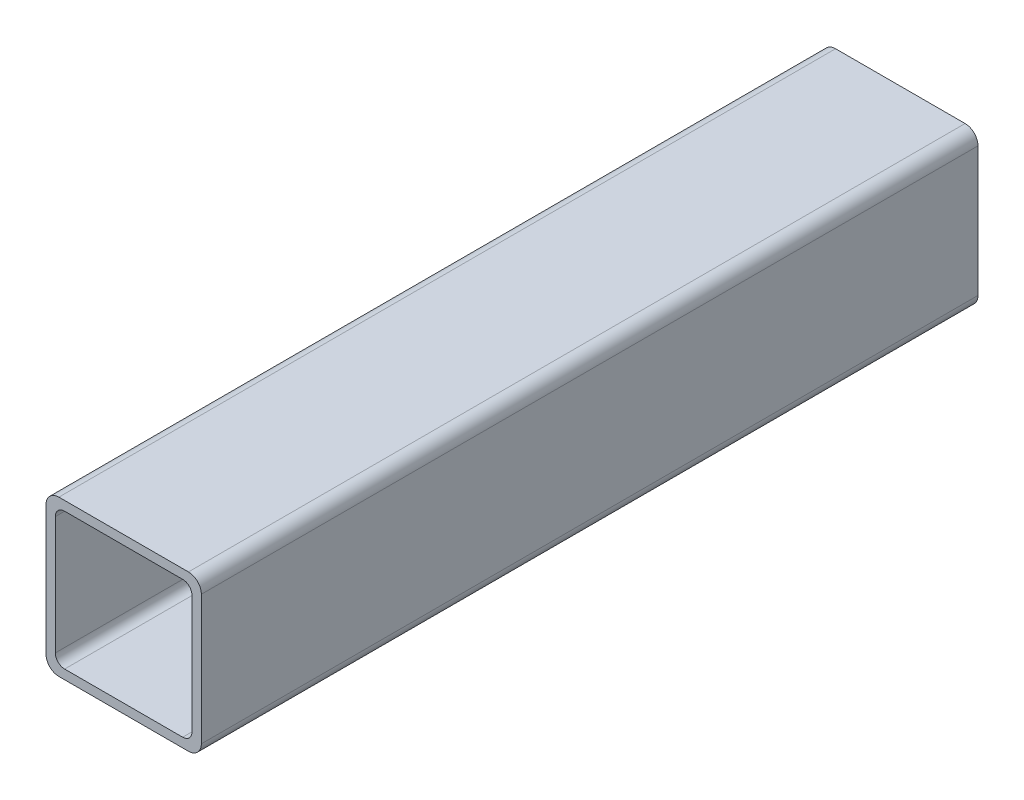
ISO-10303-21;
HEADER;
FILE_DESCRIPTION(('STEP AP214'),'2;1');
FILE_NAME('part.step','',(''),(''),'','','');
FILE_SCHEMA(('AUTOMOTIVE_DESIGN { 1 0 10303 214 1 1 1 1 }'));
ENDSEC;
DATA;
#1=APPLICATION_CONTEXT('core data for automotive mechanical design processes');
#2=APPLICATION_PROTOCOL_DEFINITION('international standard','automotive_design',2000,#1);
#3=PRODUCT_CONTEXT('',#1,'mechanical');
#4=PRODUCT('Part','Part','',(#3));
#5=PRODUCT_RELATED_PRODUCT_CATEGORY('part','',(#4));
#6=PRODUCT_DEFINITION_FORMATION('','',#4);
#7=PRODUCT_DEFINITION_CONTEXT('part definition',#1,'design');
#8=PRODUCT_DEFINITION('design','',#6,#7);
#9=PRODUCT_DEFINITION_SHAPE('','',#8);
#10=(LENGTH_UNIT() NAMED_UNIT(*) SI_UNIT(.MILLI.,.METRE.));
#11=(NAMED_UNIT(*) PLANE_ANGLE_UNIT() SI_UNIT($,.RADIAN.));
#12=(NAMED_UNIT(*) SI_UNIT($,.STERADIAN.) SOLID_ANGLE_UNIT());
#13=UNCERTAINTY_MEASURE_WITH_UNIT(LENGTH_MEASURE(1.E-05),#10,'distance_accuracy_value','');
#14=(GEOMETRIC_REPRESENTATION_CONTEXT(3) GLOBAL_UNCERTAINTY_ASSIGNED_CONTEXT((#13)) GLOBAL_UNIT_ASSIGNED_CONTEXT((#10,
#11,#12)) REPRESENTATION_CONTEXT('',''));
#15=CARTESIAN_POINT('',(0.,0.,0.));
#16=DIRECTION('',(0.,0.,1.));
#17=DIRECTION('',(1.,0.,0.));
#18=AXIS2_PLACEMENT_3D('',#15,#16,#17);
#19=CARTESIAN_POINT('',(-10.5917999999984,-10.5917999999984,-3556.));
#20=DIRECTION('',(0.,0.,-1.));
#21=DIRECTION('',(-1.,0.,0.));
#22=AXIS2_PLACEMENT_3D('',#19,#20,#21);
#23=CYLINDRICAL_SURFACE('',#22,2.10820000000163);
#24=CARTESIAN_POINT('',(-10.5917999999984,-10.5917999999984,-3683.));
#25=DIRECTION('',(0.,0.,-1.));
#26=DIRECTION('',(-1.,0.,0.));
#27=AXIS2_PLACEMENT_3D('',#24,#25,#26);
#28=CIRCLE('',#27,2.10820000000163);
#29=CARTESIAN_POINT('',(-10.5917999999984,-12.7,-3683.));
#30=VERTEX_POINT('',#29);
#31=CARTESIAN_POINT('',(-12.7,-10.5917999999984,-3683.));
#32=VERTEX_POINT('',#31);
#33=EDGE_CURVE('E202',#30,#32,#28,.T.);
#34=ORIENTED_EDGE('',*,*,#33,.F.);
#35=DIRECTION('',(0.,0.,-1.));
#36=VECTOR('',#35,1.);
#37=CARTESIAN_POINT('',(-10.5917999999984,-12.7,-3556.));
#38=LINE('',#37,#36);
#39=CARTESIAN_POINT('',(-10.5917999999984,-12.7,-3556.));
#40=VERTEX_POINT('',#39);
#41=EDGE_CURVE('E11',#40,#30,#38,.T.);
#42=ORIENTED_EDGE('',*,*,#41,.F.);
#43=CARTESIAN_POINT('',(-10.5917999999984,-10.5917999999984,-3556.));
#44=DIRECTION('',(0.,0.,-1.));
#45=DIRECTION('',(-1.,0.,0.));
#46=AXIS2_PLACEMENT_3D('',#43,#44,#45);
#47=CIRCLE('',#46,2.10820000000163);
#48=CARTESIAN_POINT('',(-12.7,-10.5917999999984,-3556.));
#49=VERTEX_POINT('',#48);
#50=EDGE_CURVE('E214',#40,#49,#47,.T.);
#51=ORIENTED_EDGE('',*,*,#50,.T.);
#52=DIRECTION('',(0.,0.,-1.));
#53=VECTOR('',#52,1.);
#54=CARTESIAN_POINT('',(-12.7,-10.5917999999984,-3556.));
#55=LINE('',#54,#53);
#56=EDGE_CURVE('E35',#49,#32,#55,.T.);
#57=ORIENTED_EDGE('',*,*,#56,.T.);
#58=EDGE_LOOP('',(#34,#42,#51,#57));
#59=FACE_BOUND('',#58,.T.);
#60=ADVANCED_FACE('F32',(#59),#23,.T.);
#61=CARTESIAN_POINT('',(10.5917999999984,-12.7,-3556.));
#62=DIRECTION('',(0.,-1.,0.));
#63=DIRECTION('',(1.,0.,0.));
#64=AXIS2_PLACEMENT_3D('',#61,#62,#63);
#65=PLANE('',#64);
#66=DIRECTION('',(-1.,0.,0.));
#67=VECTOR('',#66,1.);
#68=CARTESIAN_POINT('',(10.5917999999984,-12.7,-3683.));
#69=LINE('',#68,#67);
#70=CARTESIAN_POINT('',(10.5917999999984,-12.7,-3683.));
#71=VERTEX_POINT('',#70);
#72=EDGE_CURVE('E218',#71,#30,#69,.T.);
#73=ORIENTED_EDGE('',*,*,#72,.F.);
#74=DIRECTION('',(0.,0.,-1.));
#75=VECTOR('',#74,1.);
#76=CARTESIAN_POINT('',(10.5917999999984,-12.7,-3556.));
#77=LINE('',#76,#75);
#78=CARTESIAN_POINT('',(10.5917999999984,-12.7,-3556.));
#79=VERTEX_POINT('',#78);
#80=EDGE_CURVE('E40',#79,#71,#77,.T.);
#81=ORIENTED_EDGE('',*,*,#80,.F.);
#82=DIRECTION('',(-1.,0.,0.));
#83=VECTOR('',#82,1.);
#84=CARTESIAN_POINT('',(10.5917999999984,-12.7,-3556.));
#85=LINE('',#84,#83);
#86=EDGE_CURVE('E236',#79,#40,#85,.T.);
#87=ORIENTED_EDGE('',*,*,#86,.T.);
#88=ORIENTED_EDGE('',*,*,#41,.T.);
#89=EDGE_LOOP('',(#73,#81,#87,#88));
#90=FACE_BOUND('',#89,.T.);
#91=ADVANCED_FACE('F283',(#90),#65,.T.);
#92=CARTESIAN_POINT('',(10.5917999999984,-10.5917999999984,-3556.));
#93=DIRECTION('',(0.,0.,-1.));
#94=DIRECTION('',(-1.,0.,0.));
#95=AXIS2_PLACEMENT_3D('',#92,#93,#94);
#96=CYLINDRICAL_SURFACE('',#95,2.10820000000163);
#97=CARTESIAN_POINT('',(10.5917999999984,-10.5917999999984,-3683.));
#98=DIRECTION('',(0.,0.,-1.));
#99=DIRECTION('',(-1.,0.,0.));
#100=AXIS2_PLACEMENT_3D('',#97,#98,#99);
#101=CIRCLE('',#100,2.10820000000163);
#102=CARTESIAN_POINT('',(12.7,-10.5917999999984,-3683.));
#103=VERTEX_POINT('',#102);
#104=EDGE_CURVE('E256',#103,#71,#101,.T.);
#105=ORIENTED_EDGE('',*,*,#104,.F.);
#106=DIRECTION('',(0.,0.,-1.));
#107=VECTOR('',#106,1.);
#108=CARTESIAN_POINT('',(12.7,-10.5917999999984,-3556.));
#109=LINE('',#108,#107);
#110=CARTESIAN_POINT('',(12.7,-10.5917999999984,-3556.));
#111=VERTEX_POINT('',#110);
#112=EDGE_CURVE('E262',#111,#103,#109,.T.);
#113=ORIENTED_EDGE('',*,*,#112,.F.);
#114=CARTESIAN_POINT('',(10.5917999999984,-10.5917999999984,-3556.));
#115=DIRECTION('',(0.,0.,-1.));
#116=DIRECTION('',(-1.,0.,0.));
#117=AXIS2_PLACEMENT_3D('',#114,#115,#116);
#118=CIRCLE('',#117,2.10820000000163);
#119=EDGE_CURVE('E233',#111,#79,#118,.T.);
#120=ORIENTED_EDGE('',*,*,#119,.T.);
#121=ORIENTED_EDGE('',*,*,#80,.T.);
#122=EDGE_LOOP('',(#105,#113,#120,#121));
#123=FACE_BOUND('',#122,.T.);
#124=ADVANCED_FACE('F302',(#123),#96,.T.);
#125=CARTESIAN_POINT('',(12.7,10.5917999999984,-3556.));
#126=DIRECTION('',(1.,0.,0.));
#127=DIRECTION('',(0.,1.,0.));
#128=AXIS2_PLACEMENT_3D('',#125,#126,#127);
#129=PLANE('',#128);
#130=DIRECTION('',(0.,-1.,0.));
#131=VECTOR('',#130,1.);
#132=CARTESIAN_POINT('',(12.7,10.5917999999984,-3683.));
#133=LINE('',#132,#131);
#134=CARTESIAN_POINT('',(12.7,10.5917999999984,-3683.));
#135=VERTEX_POINT('',#134);
#136=EDGE_CURVE('E253',#135,#103,#133,.T.);
#137=ORIENTED_EDGE('',*,*,#136,.F.);
#138=DIRECTION('',(0.,0.,-1.));
#139=VECTOR('',#138,1.);
#140=CARTESIAN_POINT('',(12.7,10.5917999999984,-3556.));
#141=LINE('',#140,#139);
#142=CARTESIAN_POINT('',(12.7,10.5917999999984,-3556.));
#143=VERTEX_POINT('',#142);
#144=EDGE_CURVE('E264',#143,#135,#141,.T.);
#145=ORIENTED_EDGE('',*,*,#144,.F.);
#146=DIRECTION('',(0.,-1.,0.));
#147=VECTOR('',#146,1.);
#148=CARTESIAN_POINT('',(12.7,10.5917999999984,-3556.));
#149=LINE('',#148,#147);
#150=EDGE_CURVE('E230',#143,#111,#149,.T.);
#151=ORIENTED_EDGE('',*,*,#150,.T.);
#152=ORIENTED_EDGE('',*,*,#112,.T.);
#153=EDGE_LOOP('',(#137,#145,#151,#152));
#154=FACE_BOUND('',#153,.T.);
#155=ADVANCED_FACE('F300',(#154),#129,.T.);
#156=CARTESIAN_POINT('',(10.5917999999984,10.5917999999984,-3556.));
#157=DIRECTION('',(0.,0.,-1.));
#158=DIRECTION('',(-1.,0.,0.));
#159=AXIS2_PLACEMENT_3D('',#156,#157,#158);
#160=CYLINDRICAL_SURFACE('',#159,2.10820000000163);
#161=CARTESIAN_POINT('',(10.5917999999984,10.5917999999984,-3683.));
#162=DIRECTION('',(0.,0.,-1.));
#163=DIRECTION('',(-1.,0.,0.));
#164=AXIS2_PLACEMENT_3D('',#161,#162,#163);
#165=CIRCLE('',#164,2.10820000000163);
#166=CARTESIAN_POINT('',(10.5917999999984,12.7,-3683.));
#167=VERTEX_POINT('',#166);
#168=EDGE_CURVE('E250',#167,#135,#165,.T.);
#169=ORIENTED_EDGE('',*,*,#168,.F.);
#170=DIRECTION('',(0.,0.,-1.));
#171=VECTOR('',#170,1.);
#172=CARTESIAN_POINT('',(10.5917999999984,12.7,-3556.));
#173=LINE('',#172,#171);
#174=CARTESIAN_POINT('',(10.5917999999984,12.7,-3556.));
#175=VERTEX_POINT('',#174);
#176=EDGE_CURVE('E266',#175,#167,#173,.T.);
#177=ORIENTED_EDGE('',*,*,#176,.F.);
#178=CARTESIAN_POINT('',(10.5917999999984,10.5917999999984,-3556.));
#179=DIRECTION('',(0.,0.,-1.));
#180=DIRECTION('',(-1.,0.,0.));
#181=AXIS2_PLACEMENT_3D('',#178,#179,#180);
#182=CIRCLE('',#181,2.10820000000163);
#183=EDGE_CURVE('E227',#175,#143,#182,.T.);
#184=ORIENTED_EDGE('',*,*,#183,.T.);
#185=ORIENTED_EDGE('',*,*,#144,.T.);
#186=EDGE_LOOP('',(#169,#177,#184,#185));
#187=FACE_BOUND('',#186,.T.);
#188=ADVANCED_FACE('F296',(#187),#160,.T.);
#189=CARTESIAN_POINT('',(-10.5917999999984,12.7,-3556.));
#190=DIRECTION('',(0.,1.,0.));
#191=DIRECTION('',(-1.,0.,0.));
#192=AXIS2_PLACEMENT_3D('',#189,#190,#191);
#193=PLANE('',#192);
#194=DIRECTION('',(1.,0.,0.));
#195=VECTOR('',#194,1.);
#196=CARTESIAN_POINT('',(-10.5917999999984,12.7,-3683.));
#197=LINE('',#196,#195);
#198=CARTESIAN_POINT('',(-10.5917999999984,12.7,-3683.));
#199=VERTEX_POINT('',#198);
#200=EDGE_CURVE('E247',#199,#167,#197,.T.);
#201=ORIENTED_EDGE('',*,*,#200,.F.);
#202=DIRECTION('',(0.,0.,-1.));
#203=VECTOR('',#202,1.);
#204=CARTESIAN_POINT('',(-10.5917999999984,12.7,-3556.));
#205=LINE('',#204,#203);
#206=CARTESIAN_POINT('',(-10.5917999999984,12.7,-3556.));
#207=VERTEX_POINT('',#206);
#208=EDGE_CURVE('E268',#207,#199,#205,.T.);
#209=ORIENTED_EDGE('',*,*,#208,.F.);
#210=DIRECTION('',(1.,0.,0.));
#211=VECTOR('',#210,1.);
#212=CARTESIAN_POINT('',(-10.5917999999984,12.7,-3556.));
#213=LINE('',#212,#211);
#214=EDGE_CURVE('E224',#207,#175,#213,.T.);
#215=ORIENTED_EDGE('',*,*,#214,.T.);
#216=ORIENTED_EDGE('',*,*,#176,.T.);
#217=EDGE_LOOP('',(#201,#209,#215,#216));
#218=FACE_BOUND('',#217,.T.);
#219=ADVANCED_FACE('F294',(#218),#193,.T.);
#220=CARTESIAN_POINT('',(-10.5917999999984,10.5917999999984,-3556.));
#221=DIRECTION('',(0.,0.,-1.));
#222=DIRECTION('',(-1.,0.,0.));
#223=AXIS2_PLACEMENT_3D('',#220,#221,#222);
#224=CYLINDRICAL_SURFACE('',#223,2.10820000000163);
#225=CARTESIAN_POINT('',(-10.5917999999984,10.5917999999984,-3683.));
#226=DIRECTION('',(0.,0.,-1.));
#227=DIRECTION('',(-1.,0.,0.));
#228=AXIS2_PLACEMENT_3D('',#225,#226,#227);
#229=CIRCLE('',#228,2.10820000000163);
#230=CARTESIAN_POINT('',(-12.7,10.5917999999984,-3683.));
#231=VERTEX_POINT('',#230);
#232=EDGE_CURVE('E244',#231,#199,#229,.T.);
#233=ORIENTED_EDGE('',*,*,#232,.F.);
#234=DIRECTION('',(0.,0.,-1.));
#235=VECTOR('',#234,1.);
#236=CARTESIAN_POINT('',(-12.7,10.5917999999984,-3556.));
#237=LINE('',#236,#235);
#238=CARTESIAN_POINT('',(-12.7,10.5917999999984,-3556.));
#239=VERTEX_POINT('',#238);
#240=EDGE_CURVE('E269',#239,#231,#237,.T.);
#241=ORIENTED_EDGE('',*,*,#240,.F.);
#242=CARTESIAN_POINT('',(-10.5917999999984,10.5917999999984,-3556.));
#243=DIRECTION('',(0.,0.,-1.));
#244=DIRECTION('',(-1.,0.,0.));
#245=AXIS2_PLACEMENT_3D('',#242,#243,#244);
#246=CIRCLE('',#245,2.10820000000163);
#247=EDGE_CURVE('E221',#239,#207,#246,.T.);
#248=ORIENTED_EDGE('',*,*,#247,.T.);
#249=ORIENTED_EDGE('',*,*,#208,.T.);
#250=EDGE_LOOP('',(#233,#241,#248,#249));
#251=FACE_BOUND('',#250,.T.);
#252=ADVANCED_FACE('F290',(#251),#224,.T.);
#253=CARTESIAN_POINT('',(-12.7,-10.5917999999984,-3556.));
#254=DIRECTION('',(-1.,0.,0.));
#255=DIRECTION('',(0.,0.,1.));
#256=AXIS2_PLACEMENT_3D('',#253,#254,#255);
#257=PLANE('',#256);
#258=DIRECTION('',(0.,1.,0.));
#259=VECTOR('',#258,1.);
#260=CARTESIAN_POINT('',(-12.7,-10.5917999999984,-3683.));
#261=LINE('',#260,#259);
#262=EDGE_CURVE('E241',#32,#231,#261,.T.);
#263=ORIENTED_EDGE('',*,*,#262,.F.);
#264=ORIENTED_EDGE('',*,*,#56,.F.);
#265=DIRECTION('',(0.,1.,0.));
#266=VECTOR('',#265,1.);
#267=CARTESIAN_POINT('',(-12.7,-10.5917999999984,-3556.));
#268=LINE('',#267,#266);
#269=EDGE_CURVE('E217',#49,#239,#268,.T.);
#270=ORIENTED_EDGE('',*,*,#269,.T.);
#271=ORIENTED_EDGE('',*,*,#240,.T.);
#272=EDGE_LOOP('',(#263,#264,#270,#271));
#273=FACE_BOUND('',#272,.T.);
#274=ADVANCED_FACE('F277',(#273),#257,.T.);
#275=CARTESIAN_POINT('',(-10.5917999999984,-10.5917999999984,-3556.));
#276=DIRECTION('',(0.,0.,-1.));
#277=DIRECTION('',(-1.,0.,0.));
#278=AXIS2_PLACEMENT_3D('',#275,#276,#277);
#279=PLANE('',#278);
#280=DIRECTION('',(0.,1.,0.));
#281=VECTOR('',#280,1.);
#282=CARTESIAN_POINT('',(-11.176,9.65199999999898,-3556.));
#283=LINE('',#282,#281);
#284=CARTESIAN_POINT('',(-11.176,-9.65199999999898,-3556.));
#285=VERTEX_POINT('',#284);
#286=CARTESIAN_POINT('',(-11.176,9.65199999999898,-3556.));
#287=VERTEX_POINT('',#286);
#288=EDGE_CURVE('E153',#285,#287,#283,.T.);
#289=ORIENTED_EDGE('',*,*,#288,.T.);
#290=CARTESIAN_POINT('',(-9.65199999999898,9.65199999999898,-3556.));
#291=DIRECTION('',(0.,0.,-1.));
#292=DIRECTION('',(1.,0.,0.));
#293=AXIS2_PLACEMENT_3D('',#290,#291,#292);
#294=CIRCLE('',#293,1.52400000000102);
#295=CARTESIAN_POINT('',(-9.65199999999898,11.176,-3556.));
#296=VERTEX_POINT('',#295);
#297=EDGE_CURVE('E147',#287,#296,#294,.T.);
#298=ORIENTED_EDGE('',*,*,#297,.T.);
#299=DIRECTION('',(1.,0.,0.));
#300=VECTOR('',#299,1.);
#301=CARTESIAN_POINT('',(9.65199999999898,11.176,-3556.));
#302=LINE('',#301,#300);
#303=CARTESIAN_POINT('',(9.65199999999898,11.176,-3556.));
#304=VERTEX_POINT('',#303);
#305=EDGE_CURVE('E156',#296,#304,#302,.T.);
#306=ORIENTED_EDGE('',*,*,#305,.T.);
#307=CARTESIAN_POINT('',(9.65199999999898,9.65199999999898,-3556.));
#308=DIRECTION('',(0.,0.,-1.));
#309=DIRECTION('',(1.,0.,0.));
#310=AXIS2_PLACEMENT_3D('',#307,#308,#309);
#311=CIRCLE('',#310,1.52400000000102);
#312=CARTESIAN_POINT('',(11.176,9.65199999999898,-3556.));
#313=VERTEX_POINT('',#312);
#314=EDGE_CURVE('E48',#304,#313,#311,.T.);
#315=ORIENTED_EDGE('',*,*,#314,.T.);
#316=DIRECTION('',(0.,-1.,0.));
#317=VECTOR('',#316,1.);
#318=CARTESIAN_POINT('',(11.176,-9.65199999999898,-3556.));
#319=LINE('',#318,#317);
#320=CARTESIAN_POINT('',(11.176,-9.65199999999898,-3556.));
#321=VERTEX_POINT('',#320);
#322=EDGE_CURVE('E171',#313,#321,#319,.T.);
#323=ORIENTED_EDGE('',*,*,#322,.T.);
#324=CARTESIAN_POINT('',(9.65199999999898,-9.65199999999898,-3556.));
#325=DIRECTION('',(0.,0.,-1.));
#326=DIRECTION('',(1.,0.,0.));
#327=AXIS2_PLACEMENT_3D('',#324,#325,#326);
#328=CIRCLE('',#327,1.52400000000102);
#329=CARTESIAN_POINT('',(9.65199999999898,-11.176,-3556.));
#330=VERTEX_POINT('',#329);
#331=EDGE_CURVE('E174',#321,#330,#328,.T.);
#332=ORIENTED_EDGE('',*,*,#331,.T.);
#333=DIRECTION('',(-1.,0.,0.));
#334=VECTOR('',#333,1.);
#335=CARTESIAN_POINT('',(-9.65199999999898,-11.176,-3556.));
#336=LINE('',#335,#334);
#337=CARTESIAN_POINT('',(-9.65199999999898,-11.176,-3556.));
#338=VERTEX_POINT('',#337);
#339=EDGE_CURVE('E177',#330,#338,#336,.T.);
#340=ORIENTED_EDGE('',*,*,#339,.T.);
#341=CARTESIAN_POINT('',(-9.65199999999898,-9.65199999999898,-3556.));
#342=DIRECTION('',(0.,0.,-1.));
#343=DIRECTION('',(1.,0.,0.));
#344=AXIS2_PLACEMENT_3D('',#341,#342,#343);
#345=CIRCLE('',#344,1.52400000000102);
#346=EDGE_CURVE('E180',#338,#285,#345,.T.);
#347=ORIENTED_EDGE('',*,*,#346,.T.);
#348=EDGE_LOOP('',(#289,#298,#306,#315,#323,#332,#340,#347));
#349=FACE_BOUND('',#348,.T.);
#350=ORIENTED_EDGE('',*,*,#50,.F.);
#351=ORIENTED_EDGE('',*,*,#86,.F.);
#352=ORIENTED_EDGE('',*,*,#119,.F.);
#353=ORIENTED_EDGE('',*,*,#150,.F.);
#354=ORIENTED_EDGE('',*,*,#183,.F.);
#355=ORIENTED_EDGE('',*,*,#214,.F.);
#356=ORIENTED_EDGE('',*,*,#247,.F.);
#357=ORIENTED_EDGE('',*,*,#269,.F.);
#358=EDGE_LOOP('',(#350,#351,#352,#353,#354,#355,#356,#357));
#359=FACE_BOUND('',#358,.T.);
#360=ADVANCED_FACE('F160',(#349,#359),#279,.F.);
#361=CARTESIAN_POINT('',(-10.5917999999984,-10.5917999999984,-3683.));
#362=DIRECTION('',(0.,0.,-1.));
#363=DIRECTION('',(-1.,0.,0.));
#364=AXIS2_PLACEMENT_3D('',#361,#362,#363);
#365=PLANE('',#364);
#366=CARTESIAN_POINT('',(-9.65199999999898,9.65199999999898,-3683.));
#367=DIRECTION('',(0.,0.,-1.));
#368=DIRECTION('',(1.,0.,0.));
#369=AXIS2_PLACEMENT_3D('',#366,#367,#368);
#370=CIRCLE('',#369,1.52400000000102);
#371=CARTESIAN_POINT('',(-11.176,9.65199999999898,-3683.));
#372=VERTEX_POINT('',#371);
#373=CARTESIAN_POINT('',(-9.65199999999898,11.176,-3683.));
#374=VERTEX_POINT('',#373);
#375=EDGE_CURVE('E56',#372,#374,#370,.T.);
#376=ORIENTED_EDGE('',*,*,#375,.F.);
#377=DIRECTION('',(0.,1.,0.));
#378=VECTOR('',#377,1.);
#379=CARTESIAN_POINT('',(-11.176,9.65199999999898,-3683.));
#380=LINE('',#379,#378);
#381=CARTESIAN_POINT('',(-11.176,-9.65199999999898,-3683.));
#382=VERTEX_POINT('',#381);
#383=EDGE_CURVE('E164',#382,#372,#380,.T.);
#384=ORIENTED_EDGE('',*,*,#383,.F.);
#385=CARTESIAN_POINT('',(-9.65199999999898,-9.65199999999898,-3683.));
#386=DIRECTION('',(0.,0.,-1.));
#387=DIRECTION('',(1.,0.,0.));
#388=AXIS2_PLACEMENT_3D('',#385,#386,#387);
#389=CIRCLE('',#388,1.52400000000102);
#390=CARTESIAN_POINT('',(-9.65199999999898,-11.176,-3683.));
#391=VERTEX_POINT('',#390);
#392=EDGE_CURVE('E167',#391,#382,#389,.T.);
#393=ORIENTED_EDGE('',*,*,#392,.F.);
#394=DIRECTION('',(-1.,0.,0.));
#395=VECTOR('',#394,1.);
#396=CARTESIAN_POINT('',(-9.65199999999898,-11.176,-3683.));
#397=LINE('',#396,#395);
#398=CARTESIAN_POINT('',(9.65199999999898,-11.176,-3683.));
#399=VERTEX_POINT('',#398);
#400=EDGE_CURVE('E195',#399,#391,#397,.T.);
#401=ORIENTED_EDGE('',*,*,#400,.F.);
#402=CARTESIAN_POINT('',(9.65199999999898,-9.65199999999898,-3683.));
#403=DIRECTION('',(0.,0.,-1.));
#404=DIRECTION('',(1.,0.,0.));
#405=AXIS2_PLACEMENT_3D('',#402,#403,#404);
#406=CIRCLE('',#405,1.52400000000102);
#407=CARTESIAN_POINT('',(11.176,-9.65199999999898,-3683.));
#408=VERTEX_POINT('',#407);
#409=EDGE_CURVE('E192',#408,#399,#406,.T.);
#410=ORIENTED_EDGE('',*,*,#409,.F.);
#411=DIRECTION('',(0.,-1.,0.));
#412=VECTOR('',#411,1.);
#413=CARTESIAN_POINT('',(11.176,-9.65199999999898,-3683.));
#414=LINE('',#413,#412);
#415=CARTESIAN_POINT('',(11.176,9.65199999999898,-3683.));
#416=VERTEX_POINT('',#415);
#417=EDGE_CURVE('E189',#416,#408,#414,.T.);
#418=ORIENTED_EDGE('',*,*,#417,.F.);
#419=CARTESIAN_POINT('',(9.65199999999898,9.65199999999898,-3683.));
#420=DIRECTION('',(0.,0.,-1.));
#421=DIRECTION('',(1.,0.,0.));
#422=AXIS2_PLACEMENT_3D('',#419,#420,#421);
#423=CIRCLE('',#422,1.52400000000102);
#424=CARTESIAN_POINT('',(9.65199999999898,11.176,-3683.));
#425=VERTEX_POINT('',#424);
#426=EDGE_CURVE('E186',#425,#416,#423,.T.);
#427=ORIENTED_EDGE('',*,*,#426,.F.);
#428=DIRECTION('',(1.,0.,0.));
#429=VECTOR('',#428,1.);
#430=CARTESIAN_POINT('',(9.65199999999898,11.176,-3683.));
#431=LINE('',#430,#429);
#432=EDGE_CURVE('E184',#374,#425,#431,.T.);
#433=ORIENTED_EDGE('',*,*,#432,.F.);
#434=EDGE_LOOP('',(#376,#384,#393,#401,#410,#418,#427,#433));
#435=FACE_BOUND('',#434,.T.);
#436=ORIENTED_EDGE('',*,*,#33,.T.);
#437=ORIENTED_EDGE('',*,*,#262,.T.);
#438=ORIENTED_EDGE('',*,*,#232,.T.);
#439=ORIENTED_EDGE('',*,*,#200,.T.);
#440=ORIENTED_EDGE('',*,*,#168,.T.);
#441=ORIENTED_EDGE('',*,*,#136,.T.);
#442=ORIENTED_EDGE('',*,*,#104,.T.);
#443=ORIENTED_EDGE('',*,*,#72,.T.);
#444=EDGE_LOOP('',(#436,#437,#438,#439,#440,#441,#442,#443));
#445=FACE_BOUND('',#444,.T.);
#446=ADVANCED_FACE('F279',(#435,#445),#365,.T.);
#447=CARTESIAN_POINT('',(-9.65199999999898,9.65199999999898,-3556.));
#448=DIRECTION('',(0.,0.,-1.));
#449=DIRECTION('',(-1.,0.,0.));
#450=AXIS2_PLACEMENT_3D('',#447,#448,#449);
#451=CYLINDRICAL_SURFACE('',#450,1.52400000000102);
#452=ORIENTED_EDGE('',*,*,#375,.T.);
#453=DIRECTION('',(0.,0.,-1.));
#454=VECTOR('',#453,1.);
#455=CARTESIAN_POINT('',(-9.65199999999898,11.176,-3556.));
#456=LINE('',#455,#454);
#457=EDGE_CURVE('E143',#296,#374,#456,.T.);
#458=ORIENTED_EDGE('',*,*,#457,.F.);
#459=ORIENTED_EDGE('',*,*,#297,.F.);
#460=DIRECTION('',(0.,0.,-1.));
#461=VECTOR('',#460,1.);
#462=CARTESIAN_POINT('',(-11.176,9.65199999999898,-3556.));
#463=LINE('',#462,#461);
#464=EDGE_CURVE('E200',#287,#372,#463,.T.);
#465=ORIENTED_EDGE('',*,*,#464,.T.);
#466=EDGE_LOOP('',(#452,#458,#459,#465));
#467=FACE_BOUND('',#466,.T.);
#468=ADVANCED_FACE('F145',(#467),#451,.F.);
#469=CARTESIAN_POINT('',(-11.176,9.65199999999898,-3556.));
#470=DIRECTION('',(-1.,0.,0.));
#471=DIRECTION('',(0.,-1.,0.));
#472=AXIS2_PLACEMENT_3D('',#469,#470,#471);
#473=PLANE('',#472);
#474=ORIENTED_EDGE('',*,*,#383,.T.);
#475=ORIENTED_EDGE('',*,*,#464,.F.);
#476=ORIENTED_EDGE('',*,*,#288,.F.);
#477=DIRECTION('',(0.,0.,-1.));
#478=VECTOR('',#477,1.);
#479=CARTESIAN_POINT('',(-11.176,-9.65199999999898,-3556.));
#480=LINE('',#479,#478);
#481=EDGE_CURVE('E203',#285,#382,#480,.T.);
#482=ORIENTED_EDGE('',*,*,#481,.T.);
#483=EDGE_LOOP('',(#474,#475,#476,#482));
#484=FACE_BOUND('',#483,.T.);
#485=ADVANCED_FACE('F385',(#484),#473,.F.);
#486=CARTESIAN_POINT('',(-9.65199999999898,-9.65199999999898,-3556.));
#487=DIRECTION('',(0.,0.,-1.));
#488=DIRECTION('',(-1.,0.,0.));
#489=AXIS2_PLACEMENT_3D('',#486,#487,#488);
#490=CYLINDRICAL_SURFACE('',#489,1.52400000000102);
#491=ORIENTED_EDGE('',*,*,#392,.T.);
#492=ORIENTED_EDGE('',*,*,#481,.F.);
#493=ORIENTED_EDGE('',*,*,#346,.F.);
#494=DIRECTION('',(0.,0.,-1.));
#495=VECTOR('',#494,1.);
#496=CARTESIAN_POINT('',(-9.65199999999898,-11.176,-3556.));
#497=LINE('',#496,#495);
#498=EDGE_CURVE('E205',#338,#391,#497,.T.);
#499=ORIENTED_EDGE('',*,*,#498,.T.);
#500=EDGE_LOOP('',(#491,#492,#493,#499));
#501=FACE_BOUND('',#500,.T.);
#502=ADVANCED_FACE('F394',(#501),#490,.F.);
#503=CARTESIAN_POINT('',(-9.65199999999898,-11.176,-3556.));
#504=DIRECTION('',(0.,-1.,0.));
#505=DIRECTION('',(1.,0.,0.));
#506=AXIS2_PLACEMENT_3D('',#503,#504,#505);
#507=PLANE('',#506);
#508=ORIENTED_EDGE('',*,*,#400,.T.);
#509=ORIENTED_EDGE('',*,*,#498,.F.);
#510=ORIENTED_EDGE('',*,*,#339,.F.);
#511=DIRECTION('',(0.,0.,-1.));
#512=VECTOR('',#511,1.);
#513=CARTESIAN_POINT('',(9.65199999999898,-11.176,-3556.));
#514=LINE('',#513,#512);
#515=EDGE_CURVE('E207',#330,#399,#514,.T.);
#516=ORIENTED_EDGE('',*,*,#515,.T.);
#517=EDGE_LOOP('',(#508,#509,#510,#516));
#518=FACE_BOUND('',#517,.T.);
#519=ADVANCED_FACE('F404',(#518),#507,.F.);
#520=CARTESIAN_POINT('',(9.65199999999898,-9.65199999999898,-3556.));
#521=DIRECTION('',(0.,0.,-1.));
#522=DIRECTION('',(-1.,0.,0.));
#523=AXIS2_PLACEMENT_3D('',#520,#521,#522);
#524=CYLINDRICAL_SURFACE('',#523,1.52400000000102);
#525=ORIENTED_EDGE('',*,*,#409,.T.);
#526=ORIENTED_EDGE('',*,*,#515,.F.);
#527=ORIENTED_EDGE('',*,*,#331,.F.);
#528=DIRECTION('',(0.,0.,-1.));
#529=VECTOR('',#528,1.);
#530=CARTESIAN_POINT('',(11.176,-9.65199999999898,-3556.));
#531=LINE('',#530,#529);
#532=EDGE_CURVE('E209',#321,#408,#531,.T.);
#533=ORIENTED_EDGE('',*,*,#532,.T.);
#534=EDGE_LOOP('',(#525,#526,#527,#533));
#535=FACE_BOUND('',#534,.T.);
#536=ADVANCED_FACE('F414',(#535),#524,.F.);
#537=CARTESIAN_POINT('',(11.176,-9.65199999999898,-3556.));
#538=DIRECTION('',(1.,0.,0.));
#539=DIRECTION('',(0.,0.,-1.));
#540=AXIS2_PLACEMENT_3D('',#537,#538,#539);
#541=PLANE('',#540);
#542=ORIENTED_EDGE('',*,*,#417,.T.);
#543=ORIENTED_EDGE('',*,*,#532,.F.);
#544=ORIENTED_EDGE('',*,*,#322,.F.);
#545=DIRECTION('',(0.,0.,-1.));
#546=VECTOR('',#545,1.);
#547=CARTESIAN_POINT('',(11.176,9.65199999999898,-3556.));
#548=LINE('',#547,#546);
#549=EDGE_CURVE('E211',#313,#416,#548,.T.);
#550=ORIENTED_EDGE('',*,*,#549,.T.);
#551=EDGE_LOOP('',(#542,#543,#544,#550));
#552=FACE_BOUND('',#551,.T.);
#553=ADVANCED_FACE('F424',(#552),#541,.F.);
#554=CARTESIAN_POINT('',(9.65199999999898,9.65199999999898,-3556.));
#555=DIRECTION('',(0.,0.,-1.));
#556=DIRECTION('',(-1.,0.,0.));
#557=AXIS2_PLACEMENT_3D('',#554,#555,#556);
#558=CYLINDRICAL_SURFACE('',#557,1.52400000000102);
#559=ORIENTED_EDGE('',*,*,#426,.T.);
#560=ORIENTED_EDGE('',*,*,#549,.F.);
#561=ORIENTED_EDGE('',*,*,#314,.F.);
#562=DIRECTION('',(0.,0.,-1.));
#563=VECTOR('',#562,1.);
#564=CARTESIAN_POINT('',(9.65199999999898,11.176,-3556.));
#565=LINE('',#564,#563);
#566=EDGE_CURVE('E152',#304,#425,#565,.T.);
#567=ORIENTED_EDGE('',*,*,#566,.T.);
#568=EDGE_LOOP('',(#559,#560,#561,#567));
#569=FACE_BOUND('',#568,.T.);
#570=ADVANCED_FACE('F434',(#569),#558,.F.);
#571=CARTESIAN_POINT('',(9.65199999999898,11.176,-3556.));
#572=DIRECTION('',(0.,1.,0.));
#573=DIRECTION('',(0.,0.,1.));
#574=AXIS2_PLACEMENT_3D('',#571,#572,#573);
#575=PLANE('',#574);
#576=ORIENTED_EDGE('',*,*,#432,.T.);
#577=ORIENTED_EDGE('',*,*,#566,.F.);
#578=ORIENTED_EDGE('',*,*,#305,.F.);
#579=ORIENTED_EDGE('',*,*,#457,.T.);
#580=EDGE_LOOP('',(#576,#577,#578,#579));
#581=FACE_BOUND('',#580,.T.);
#582=ADVANCED_FACE('F157',(#581),#575,.F.);
#583=CLOSED_SHELL('',(#60,#91,#124,#155,#188,#219,#252,#274,#360,#446,#468,#485,#502,#519,#536,
#553,#570,#582));
#584=MANIFOLD_SOLID_BREP('B2',#583);
#585=ADVANCED_BREP_SHAPE_REPRESENTATION('',(#18,#584),#14);
#586=SHAPE_DEFINITION_REPRESENTATION(#9,#585);
ENDSEC;
END-ISO-10303-21;
